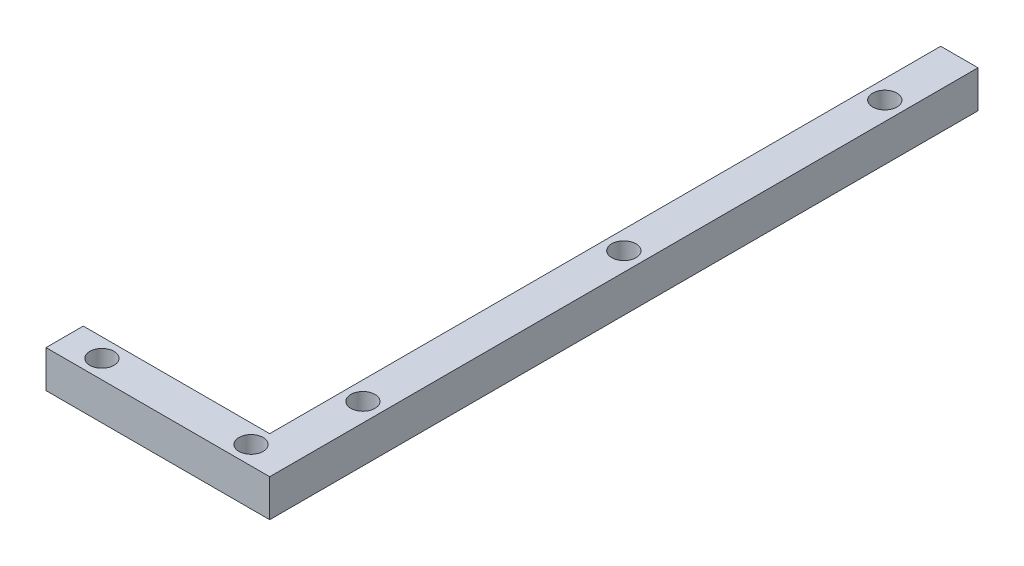
ISO-10303-21;
HEADER;
FILE_DESCRIPTION(('STEP AP214'),'2;1');
FILE_NAME('part.step','',(''),(''),'','','');
FILE_SCHEMA(('AUTOMOTIVE_DESIGN { 1 0 10303 214 1 1 1 1 }'));
ENDSEC;
DATA;
#1=APPLICATION_CONTEXT('core data for automotive mechanical design processes');
#2=APPLICATION_PROTOCOL_DEFINITION('international standard','automotive_design',2000,#1);
#3=PRODUCT_CONTEXT('',#1,'mechanical');
#4=PRODUCT('Part','Part','',(#3));
#5=PRODUCT_RELATED_PRODUCT_CATEGORY('part','',(#4));
#6=PRODUCT_DEFINITION_FORMATION('','',#4);
#7=PRODUCT_DEFINITION_CONTEXT('part definition',#1,'design');
#8=PRODUCT_DEFINITION('design','',#6,#7);
#9=PRODUCT_DEFINITION_SHAPE('','',#8);
#10=(LENGTH_UNIT() NAMED_UNIT(*) SI_UNIT(.MILLI.,.METRE.));
#11=(NAMED_UNIT(*) PLANE_ANGLE_UNIT() SI_UNIT($,.RADIAN.));
#12=(NAMED_UNIT(*) SI_UNIT($,.STERADIAN.) SOLID_ANGLE_UNIT());
#13=UNCERTAINTY_MEASURE_WITH_UNIT(LENGTH_MEASURE(1.E-05),#10,'distance_accuracy_value','');
#14=(GEOMETRIC_REPRESENTATION_CONTEXT(3) GLOBAL_UNCERTAINTY_ASSIGNED_CONTEXT((#13)) GLOBAL_UNIT_ASSIGNED_CONTEXT((#10,
#11,#12)) REPRESENTATION_CONTEXT('',''));
#15=CARTESIAN_POINT('',(0.,0.,0.));
#16=DIRECTION('',(0.,0.,1.));
#17=DIRECTION('',(1.,0.,0.));
#18=AXIS2_PLACEMENT_3D('',#15,#16,#17);
#19=CARTESIAN_POINT('',(0.,10.,-180.));
#20=DIRECTION('',(0.,0.,-1.));
#21=DIRECTION('',(-1.,0.,0.));
#22=AXIS2_PLACEMENT_3D('',#19,#20,#21);
#23=PLANE('',#22);
#24=DIRECTION('',(1.,0.,0.));
#25=VECTOR('',#24,1.);
#26=CARTESIAN_POINT('',(0.,0.,-180.));
#27=LINE('',#26,#25);
#28=CARTESIAN_POINT('',(0.,0.,-180.));
#29=VERTEX_POINT('',#28);
#30=CARTESIAN_POINT('',(10.,0.,-180.));
#31=VERTEX_POINT('',#30);
#32=EDGE_CURVE('E118',#29,#31,#27,.T.);
#33=ORIENTED_EDGE('',*,*,#32,.F.);
#34=DIRECTION('',(0.,-1.,0.));
#35=VECTOR('',#34,1.);
#36=CARTESIAN_POINT('',(0.,10.,-180.));
#37=LINE('',#36,#35);
#38=CARTESIAN_POINT('',(0.,10.,-180.));
#39=VERTEX_POINT('',#38);
#40=EDGE_CURVE('E11',#39,#29,#37,.T.);
#41=ORIENTED_EDGE('',*,*,#40,.F.);
#42=DIRECTION('',(1.,0.,0.));
#43=VECTOR('',#42,1.);
#44=CARTESIAN_POINT('',(0.,10.,-180.));
#45=LINE('',#44,#43);
#46=CARTESIAN_POINT('',(10.,10.,-180.));
#47=VERTEX_POINT('',#46);
#48=EDGE_CURVE('E133',#39,#47,#45,.T.);
#49=ORIENTED_EDGE('',*,*,#48,.T.);
#50=DIRECTION('',(0.,-1.,0.));
#51=VECTOR('',#50,1.);
#52=CARTESIAN_POINT('',(10.,10.,-180.));
#53=LINE('',#52,#51);
#54=EDGE_CURVE('E36',#47,#31,#53,.T.);
#55=ORIENTED_EDGE('',*,*,#54,.T.);
#56=EDGE_LOOP('',(#33,#41,#49,#55));
#57=FACE_BOUND('',#56,.T.);
#58=ADVANCED_FACE('F33',(#57),#23,.T.);
#59=CARTESIAN_POINT('',(0.,10.,0.));
#60=DIRECTION('',(-1.,0.,0.));
#61=DIRECTION('',(0.,0.,1.));
#62=AXIS2_PLACEMENT_3D('',#59,#60,#61);
#63=PLANE('',#62);
#64=DIRECTION('',(0.,0.,-1.));
#65=VECTOR('',#64,1.);
#66=CARTESIAN_POINT('',(0.,0.,0.));
#67=LINE('',#66,#65);
#68=CARTESIAN_POINT('',(0.,0.,0.));
#69=VERTEX_POINT('',#68);
#70=EDGE_CURVE('E131',#69,#29,#67,.T.);
#71=ORIENTED_EDGE('',*,*,#70,.F.);
#72=DIRECTION('',(0.,-1.,0.));
#73=VECTOR('',#72,1.);
#74=CARTESIAN_POINT('',(0.,10.,0.));
#75=LINE('',#74,#73);
#76=CARTESIAN_POINT('',(0.,10.,0.));
#77=VERTEX_POINT('',#76);
#78=EDGE_CURVE('E42',#77,#69,#75,.T.);
#79=ORIENTED_EDGE('',*,*,#78,.F.);
#80=DIRECTION('',(0.,0.,-1.));
#81=VECTOR('',#80,1.);
#82=CARTESIAN_POINT('',(0.,10.,0.));
#83=LINE('',#82,#81);
#84=EDGE_CURVE('E108',#77,#39,#83,.T.);
#85=ORIENTED_EDGE('',*,*,#84,.T.);
#86=ORIENTED_EDGE('',*,*,#40,.T.);
#87=EDGE_LOOP('',(#71,#79,#85,#86));
#88=FACE_BOUND('',#87,.T.);
#89=ADVANCED_FACE('F141',(#88),#63,.T.);
#90=CARTESIAN_POINT('',(-50.,10.,0.));
#91=DIRECTION('',(0.,0.,-1.));
#92=DIRECTION('',(-1.,0.,0.));
#93=AXIS2_PLACEMENT_3D('',#90,#91,#92);
#94=PLANE('',#93);
#95=DIRECTION('',(1.,0.,0.));
#96=VECTOR('',#95,1.);
#97=CARTESIAN_POINT('',(-50.,0.,0.));
#98=LINE('',#97,#96);
#99=CARTESIAN_POINT('',(-50.,0.,0.));
#100=VERTEX_POINT('',#99);
#101=EDGE_CURVE('E95',#100,#69,#98,.T.);
#102=ORIENTED_EDGE('',*,*,#101,.F.);
#103=DIRECTION('',(0.,-1.,0.));
#104=VECTOR('',#103,1.);
#105=CARTESIAN_POINT('',(-50.,10.,0.));
#106=LINE('',#105,#104);
#107=CARTESIAN_POINT('',(-50.,10.,0.));
#108=VERTEX_POINT('',#107);
#109=EDGE_CURVE('E90',#108,#100,#106,.T.);
#110=ORIENTED_EDGE('',*,*,#109,.F.);
#111=DIRECTION('',(1.,0.,0.));
#112=VECTOR('',#111,1.);
#113=CARTESIAN_POINT('',(-50.,10.,0.));
#114=LINE('',#113,#112);
#115=EDGE_CURVE('E93',#108,#77,#114,.T.);
#116=ORIENTED_EDGE('',*,*,#115,.T.);
#117=ORIENTED_EDGE('',*,*,#78,.T.);
#118=EDGE_LOOP('',(#102,#110,#116,#117));
#119=FACE_BOUND('',#118,.T.);
#120=ADVANCED_FACE('F92',(#119),#94,.T.);
#121=CARTESIAN_POINT('',(-50.,10.,10.));
#122=DIRECTION('',(-1.,0.,0.));
#123=DIRECTION('',(0.,0.,1.));
#124=AXIS2_PLACEMENT_3D('',#121,#122,#123);
#125=PLANE('',#124);
#126=DIRECTION('',(0.,0.,-1.));
#127=VECTOR('',#126,1.);
#128=CARTESIAN_POINT('',(-50.,0.,10.));
#129=LINE('',#128,#127);
#130=CARTESIAN_POINT('',(-50.,0.,10.));
#131=VERTEX_POINT('',#130);
#132=EDGE_CURVE('E128',#131,#100,#129,.T.);
#133=ORIENTED_EDGE('',*,*,#132,.F.);
#134=DIRECTION('',(0.,-1.,0.));
#135=VECTOR('',#134,1.);
#136=CARTESIAN_POINT('',(-50.,10.,10.));
#137=LINE('',#136,#135);
#138=CARTESIAN_POINT('',(-50.,10.,10.));
#139=VERTEX_POINT('',#138);
#140=EDGE_CURVE('E100',#139,#131,#137,.T.);
#141=ORIENTED_EDGE('',*,*,#140,.F.);
#142=DIRECTION('',(0.,0.,-1.));
#143=VECTOR('',#142,1.);
#144=CARTESIAN_POINT('',(-50.,10.,10.));
#145=LINE('',#144,#143);
#146=EDGE_CURVE('E106',#139,#108,#145,.T.);
#147=ORIENTED_EDGE('',*,*,#146,.T.);
#148=ORIENTED_EDGE('',*,*,#109,.T.);
#149=EDGE_LOOP('',(#133,#141,#147,#148));
#150=FACE_BOUND('',#149,.T.);
#151=ADVANCED_FACE('F110',(#150),#125,.T.);
#152=CARTESIAN_POINT('',(10.,10.,9.99999999999999));
#153=DIRECTION('',(0.,0.,1.));
#154=DIRECTION('',(1.,0.,0.));
#155=AXIS2_PLACEMENT_3D('',#152,#153,#154);
#156=PLANE('',#155);
#157=DIRECTION('',(-1.,0.,0.));
#158=VECTOR('',#157,1.);
#159=CARTESIAN_POINT('',(10.,0.,9.99999999999999));
#160=LINE('',#159,#158);
#161=CARTESIAN_POINT('',(10.,0.,9.99999999999999));
#162=VERTEX_POINT('',#161);
#163=EDGE_CURVE('E125',#162,#131,#160,.T.);
#164=ORIENTED_EDGE('',*,*,#163,.F.);
#165=DIRECTION('',(0.,-1.,0.));
#166=VECTOR('',#165,1.);
#167=CARTESIAN_POINT('',(10.,10.,9.99999999999999));
#168=LINE('',#167,#166);
#169=CARTESIAN_POINT('',(10.,10.,9.99999999999999));
#170=VERTEX_POINT('',#169);
#171=EDGE_CURVE('E136',#170,#162,#168,.T.);
#172=ORIENTED_EDGE('',*,*,#171,.F.);
#173=DIRECTION('',(-1.,0.,0.));
#174=VECTOR('',#173,1.);
#175=CARTESIAN_POINT('',(10.,10.,9.99999999999999));
#176=LINE('',#175,#174);
#177=EDGE_CURVE('E111',#170,#139,#176,.T.);
#178=ORIENTED_EDGE('',*,*,#177,.T.);
#179=ORIENTED_EDGE('',*,*,#140,.T.);
#180=EDGE_LOOP('',(#164,#172,#178,#179));
#181=FACE_BOUND('',#180,.T.);
#182=ADVANCED_FACE('F154',(#181),#156,.T.);
#183=CARTESIAN_POINT('',(10.,10.,-180.));
#184=DIRECTION('',(1.,0.,0.));
#185=DIRECTION('',(0.,0.,-1.));
#186=AXIS2_PLACEMENT_3D('',#183,#184,#185);
#187=PLANE('',#186);
#188=DIRECTION('',(0.,0.,1.));
#189=VECTOR('',#188,1.);
#190=CARTESIAN_POINT('',(10.,0.,-180.));
#191=LINE('',#190,#189);
#192=EDGE_CURVE('E121',#31,#162,#191,.T.);
#193=ORIENTED_EDGE('',*,*,#192,.F.);
#194=ORIENTED_EDGE('',*,*,#54,.F.);
#195=DIRECTION('',(0.,0.,1.));
#196=VECTOR('',#195,1.);
#197=CARTESIAN_POINT('',(10.,10.,-180.));
#198=LINE('',#197,#196);
#199=EDGE_CURVE('E113',#47,#170,#198,.T.);
#200=ORIENTED_EDGE('',*,*,#199,.T.);
#201=ORIENTED_EDGE('',*,*,#171,.T.);
#202=EDGE_LOOP('',(#193,#194,#200,#201));
#203=FACE_BOUND('',#202,.T.);
#204=ADVANCED_FACE('F138',(#203),#187,.T.);
#205=CARTESIAN_POINT('',(0.,10.,0.));
#206=DIRECTION('',(0.,-1.,0.));
#207=DIRECTION('',(0.,0.,-1.));
#208=AXIS2_PLACEMENT_3D('',#205,#206,#207);
#209=PLANE('',#208);
#210=CARTESIAN_POINT('',(5.,10.,-90.));
#211=DIRECTION('',(0.,1.,0.));
#212=DIRECTION('',(0.,0.,1.));
#213=AXIS2_PLACEMENT_3D('',#210,#211,#212);
#214=CIRCLE('',#213,3.25);
#215=CARTESIAN_POINT('',(5.,10.,-86.75));
#216=VERTEX_POINT('',#215);
#217=EDGE_CURVE('E195',#216,#216,#214,.T.);
#218=ORIENTED_EDGE('',*,*,#217,.F.);
#219=EDGE_LOOP('',(#218));
#220=FACE_BOUND('',#219,.T.);
#221=CARTESIAN_POINT('',(5.,10.,-20.));
#222=DIRECTION('',(0.,1.,0.));
#223=DIRECTION('',(0.,0.,1.));
#224=AXIS2_PLACEMENT_3D('',#221,#222,#223);
#225=CIRCLE('',#224,3.25);
#226=CARTESIAN_POINT('',(5.,10.,-16.75));
#227=VERTEX_POINT('',#226);
#228=EDGE_CURVE('E201',#227,#227,#225,.T.);
#229=ORIENTED_EDGE('',*,*,#228,.F.);
#230=EDGE_LOOP('',(#229));
#231=FACE_BOUND('',#230,.T.);
#232=CARTESIAN_POINT('',(-40.,10.,5.));
#233=DIRECTION('',(0.,1.,0.));
#234=DIRECTION('',(0.,0.,1.));
#235=AXIS2_PLACEMENT_3D('',#232,#233,#234);
#236=CIRCLE('',#235,3.25);
#237=CARTESIAN_POINT('',(-40.,10.,8.25));
#238=VERTEX_POINT('',#237);
#239=EDGE_CURVE('E209',#238,#238,#236,.T.);
#240=ORIENTED_EDGE('',*,*,#239,.F.);
#241=EDGE_LOOP('',(#240));
#242=FACE_BOUND('',#241,.T.);
#243=CARTESIAN_POINT('',(0.,10.,5.));
#244=DIRECTION('',(0.,1.,0.));
#245=DIRECTION('',(0.,0.,1.));
#246=AXIS2_PLACEMENT_3D('',#243,#244,#245);
#247=CIRCLE('',#246,3.25);
#248=CARTESIAN_POINT('',(0.,10.,8.25));
#249=VERTEX_POINT('',#248);
#250=EDGE_CURVE('E215',#249,#249,#247,.T.);
#251=ORIENTED_EDGE('',*,*,#250,.F.);
#252=EDGE_LOOP('',(#251));
#253=FACE_BOUND('',#252,.T.);
#254=CARTESIAN_POINT('',(5.,10.,-160.));
#255=DIRECTION('',(0.,1.,0.));
#256=DIRECTION('',(0.,0.,1.));
#257=AXIS2_PLACEMENT_3D('',#254,#255,#256);
#258=CIRCLE('',#257,3.25);
#259=CARTESIAN_POINT('',(5.,10.,-156.75));
#260=VERTEX_POINT('',#259);
#261=EDGE_CURVE('E198',#260,#260,#258,.T.);
#262=ORIENTED_EDGE('',*,*,#261,.F.);
#263=EDGE_LOOP('',(#262));
#264=FACE_BOUND('',#263,.T.);
#265=ORIENTED_EDGE('',*,*,#48,.F.);
#266=ORIENTED_EDGE('',*,*,#84,.F.);
#267=ORIENTED_EDGE('',*,*,#115,.F.);
#268=ORIENTED_EDGE('',*,*,#146,.F.);
#269=ORIENTED_EDGE('',*,*,#177,.F.);
#270=ORIENTED_EDGE('',*,*,#199,.F.);
#271=EDGE_LOOP('',(#265,#266,#267,#268,#269,#270));
#272=FACE_BOUND('',#271,.T.);
#273=ADVANCED_FACE('F104',(#220,#231,#242,#253,#264,#272),#209,.F.);
#274=CARTESIAN_POINT('',(0.,0.,0.));
#275=DIRECTION('',(0.,-1.,0.));
#276=DIRECTION('',(0.,0.,-1.));
#277=AXIS2_PLACEMENT_3D('',#274,#275,#276);
#278=PLANE('',#277);
#279=CARTESIAN_POINT('',(5.,0.,-90.));
#280=DIRECTION('',(0.,1.,0.));
#281=DIRECTION('',(0.,0.,1.));
#282=AXIS2_PLACEMENT_3D('',#279,#280,#281);
#283=CIRCLE('',#282,3.25);
#284=CARTESIAN_POINT('',(5.,0.,-86.75));
#285=VERTEX_POINT('',#284);
#286=EDGE_CURVE('E193',#285,#285,#283,.T.);
#287=ORIENTED_EDGE('',*,*,#286,.T.);
#288=EDGE_LOOP('',(#287));
#289=FACE_BOUND('',#288,.T.);
#290=CARTESIAN_POINT('',(5.,0.,-20.));
#291=DIRECTION('',(0.,1.,0.));
#292=DIRECTION('',(0.,0.,1.));
#293=AXIS2_PLACEMENT_3D('',#290,#291,#292);
#294=CIRCLE('',#293,3.25);
#295=CARTESIAN_POINT('',(5.,0.,-16.75));
#296=VERTEX_POINT('',#295);
#297=EDGE_CURVE('E196',#296,#296,#294,.T.);
#298=ORIENTED_EDGE('',*,*,#297,.T.);
#299=EDGE_LOOP('',(#298));
#300=FACE_BOUND('',#299,.T.);
#301=CARTESIAN_POINT('',(-40.,0.,5.));
#302=DIRECTION('',(0.,1.,0.));
#303=DIRECTION('',(0.,0.,1.));
#304=AXIS2_PLACEMENT_3D('',#301,#302,#303);
#305=CIRCLE('',#304,3.25);
#306=CARTESIAN_POINT('',(-40.,0.,8.25));
#307=VERTEX_POINT('',#306);
#308=EDGE_CURVE('E206',#307,#307,#305,.T.);
#309=ORIENTED_EDGE('',*,*,#308,.T.);
#310=EDGE_LOOP('',(#309));
#311=FACE_BOUND('',#310,.T.);
#312=CARTESIAN_POINT('',(0.,0.,5.));
#313=DIRECTION('',(0.,1.,0.));
#314=DIRECTION('',(0.,0.,1.));
#315=AXIS2_PLACEMENT_3D('',#312,#313,#314);
#316=CIRCLE('',#315,3.25);
#317=CARTESIAN_POINT('',(0.,0.,8.25));
#318=VERTEX_POINT('',#317);
#319=EDGE_CURVE('E212',#318,#318,#316,.T.);
#320=ORIENTED_EDGE('',*,*,#319,.T.);
#321=EDGE_LOOP('',(#320));
#322=FACE_BOUND('',#321,.T.);
#323=CARTESIAN_POINT('',(5.,0.,-160.));
#324=DIRECTION('',(0.,1.,0.));
#325=DIRECTION('',(0.,0.,1.));
#326=AXIS2_PLACEMENT_3D('',#323,#324,#325);
#327=CIRCLE('',#326,3.25);
#328=CARTESIAN_POINT('',(5.,0.,-156.75));
#329=VERTEX_POINT('',#328);
#330=EDGE_CURVE('E122',#329,#329,#327,.T.);
#331=ORIENTED_EDGE('',*,*,#330,.T.);
#332=EDGE_LOOP('',(#331));
#333=FACE_BOUND('',#332,.T.);
#334=ORIENTED_EDGE('',*,*,#32,.T.);
#335=ORIENTED_EDGE('',*,*,#192,.T.);
#336=ORIENTED_EDGE('',*,*,#163,.T.);
#337=ORIENTED_EDGE('',*,*,#132,.T.);
#338=ORIENTED_EDGE('',*,*,#101,.T.);
#339=ORIENTED_EDGE('',*,*,#70,.T.);
#340=EDGE_LOOP('',(#334,#335,#336,#337,#338,#339));
#341=FACE_BOUND('',#340,.T.);
#342=ADVANCED_FACE('F140',(#289,#300,#311,#322,#333,#341),#278,.T.);
#343=CARTESIAN_POINT('',(5.,0.,-160.));
#344=DIRECTION('',(0.,1.,0.));
#345=DIRECTION('',(0.,0.,1.));
#346=AXIS2_PLACEMENT_3D('',#343,#344,#345);
#347=CYLINDRICAL_SURFACE('',#346,3.25);
#348=ORIENTED_EDGE('',*,*,#330,.F.);
#349=EDGE_LOOP('',(#348));
#350=FACE_BOUND('',#349,.T.);
#351=ORIENTED_EDGE('',*,*,#261,.T.);
#352=EDGE_LOOP('',(#351));
#353=FACE_BOUND('',#352,.T.);
#354=ADVANCED_FACE('F165',(#350,#353),#347,.F.);
#355=CARTESIAN_POINT('',(0.,0.,5.));
#356=DIRECTION('',(0.,1.,0.));
#357=DIRECTION('',(0.,0.,1.));
#358=AXIS2_PLACEMENT_3D('',#355,#356,#357);
#359=CYLINDRICAL_SURFACE('',#358,3.25);
#360=ORIENTED_EDGE('',*,*,#319,.F.);
#361=EDGE_LOOP('',(#360));
#362=FACE_BOUND('',#361,.T.);
#363=ORIENTED_EDGE('',*,*,#250,.T.);
#364=EDGE_LOOP('',(#363));
#365=FACE_BOUND('',#364,.T.);
#366=ADVANCED_FACE('F172',(#362,#365),#359,.F.);
#367=CARTESIAN_POINT('',(-40.,0.,5.));
#368=DIRECTION('',(0.,1.,0.));
#369=DIRECTION('',(0.,0.,1.));
#370=AXIS2_PLACEMENT_3D('',#367,#368,#369);
#371=CYLINDRICAL_SURFACE('',#370,3.25);
#372=ORIENTED_EDGE('',*,*,#308,.F.);
#373=EDGE_LOOP('',(#372));
#374=FACE_BOUND('',#373,.T.);
#375=ORIENTED_EDGE('',*,*,#239,.T.);
#376=EDGE_LOOP('',(#375));
#377=FACE_BOUND('',#376,.T.);
#378=ADVANCED_FACE('F176',(#374,#377),#371,.F.);
#379=CARTESIAN_POINT('',(5.,0.,-20.));
#380=DIRECTION('',(0.,1.,0.));
#381=DIRECTION('',(0.,0.,1.));
#382=AXIS2_PLACEMENT_3D('',#379,#380,#381);
#383=CYLINDRICAL_SURFACE('',#382,3.25);
#384=ORIENTED_EDGE('',*,*,#297,.F.);
#385=EDGE_LOOP('',(#384));
#386=FACE_BOUND('',#385,.T.);
#387=ORIENTED_EDGE('',*,*,#228,.T.);
#388=EDGE_LOOP('',(#387));
#389=FACE_BOUND('',#388,.T.);
#390=ADVANCED_FACE('F180',(#386,#389),#383,.F.);
#391=CARTESIAN_POINT('',(5.,0.,-90.));
#392=DIRECTION('',(0.,1.,0.));
#393=DIRECTION('',(0.,0.,1.));
#394=AXIS2_PLACEMENT_3D('',#391,#392,#393);
#395=CYLINDRICAL_SURFACE('',#394,3.25);
#396=ORIENTED_EDGE('',*,*,#286,.F.);
#397=EDGE_LOOP('',(#396));
#398=FACE_BOUND('',#397,.T.);
#399=ORIENTED_EDGE('',*,*,#217,.T.);
#400=EDGE_LOOP('',(#399));
#401=FACE_BOUND('',#400,.T.);
#402=ADVANCED_FACE('F184',(#398,#401),#395,.F.);
#403=CLOSED_SHELL('',(#58,#89,#120,#151,#182,#204,#273,#342,#354,#366,#378,#390,#402));
#404=MANIFOLD_SOLID_BREP('B2',#403);
#405=ADVANCED_BREP_SHAPE_REPRESENTATION('',(#18,#404),#14);
#406=SHAPE_DEFINITION_REPRESENTATION(#9,#405);
ENDSEC;
END-ISO-10303-21;
